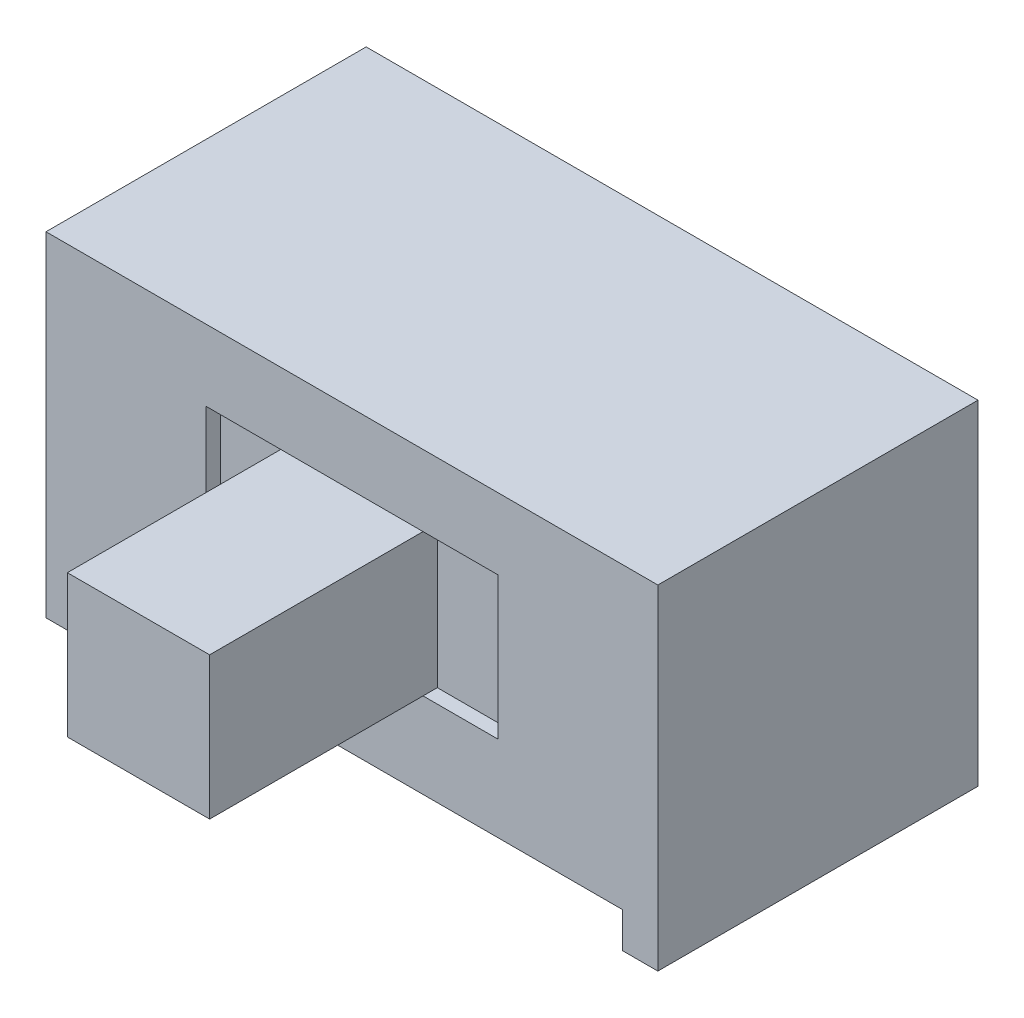
ISO-10303-21;
HEADER;
FILE_DESCRIPTION(('STEP AP214'),'2;1');
FILE_NAME('part.step','',(''),(''),'','','');
FILE_SCHEMA(('AUTOMOTIVE_DESIGN { 1 0 10303 214 1 1 1 1 }'));
ENDSEC;
DATA;
#1=APPLICATION_CONTEXT('core data for automotive mechanical design processes');
#2=APPLICATION_PROTOCOL_DEFINITION('international standard','automotive_design',2000,#1);
#3=PRODUCT_CONTEXT('',#1,'mechanical');
#4=PRODUCT('Part','Part','',(#3));
#5=PRODUCT_RELATED_PRODUCT_CATEGORY('part','',(#4));
#6=PRODUCT_DEFINITION_FORMATION('','',#4);
#7=PRODUCT_DEFINITION_CONTEXT('part definition',#1,'design');
#8=PRODUCT_DEFINITION('design','',#6,#7);
#9=PRODUCT_DEFINITION_SHAPE('','',#8);
#10=(LENGTH_UNIT() NAMED_UNIT(*) SI_UNIT(.MILLI.,.METRE.));
#11=(NAMED_UNIT(*) PLANE_ANGLE_UNIT() SI_UNIT($,.RADIAN.));
#12=(NAMED_UNIT(*) SI_UNIT($,.STERADIAN.) SOLID_ANGLE_UNIT());
#13=UNCERTAINTY_MEASURE_WITH_UNIT(LENGTH_MEASURE(1.E-05),#10,'distance_accuracy_value','');
#14=(GEOMETRIC_REPRESENTATION_CONTEXT(3) GLOBAL_UNCERTAINTY_ASSIGNED_CONTEXT((#13)) GLOBAL_UNIT_ASSIGNED_CONTEXT((#10,
#11,#12)) REPRESENTATION_CONTEXT('',''));
#15=CARTESIAN_POINT('',(0.,0.,0.));
#16=DIRECTION('',(0.,0.,1.));
#17=DIRECTION('',(1.,0.,0.));
#18=AXIS2_PLACEMENT_3D('',#15,#16,#17);
#19=CARTESIAN_POINT('',(2.25,3.7,-0.2));
#20=DIRECTION('',(0.,1.,0.));
#21=DIRECTION('',(-1.,0.,0.));
#22=AXIS2_PLACEMENT_3D('',#19,#20,#21);
#23=PLANE('',#22);
#24=DIRECTION('',(-1.,0.,0.));
#25=VECTOR('',#24,1.);
#26=CARTESIAN_POINT('',(2.25,3.7,-0.2));
#27=LINE('',#26,#25);
#28=CARTESIAN_POINT('',(3.3,3.7,-0.2));
#29=VERTEX_POINT('',#28);
#30=CARTESIAN_POINT('',(2.25,3.7,-0.2));
#31=VERTEX_POINT('',#30);
#32=EDGE_CURVE('E243',#29,#31,#27,.T.);
#33=ORIENTED_EDGE('',*,*,#32,.F.);
#34=DIRECTION('',(0.,0.,1.));
#35=VECTOR('',#34,1.);
#36=CARTESIAN_POINT('',(3.3,3.7,-3.02842712474619));
#37=LINE('',#36,#35);
#38=CARTESIAN_POINT('',(3.3,3.7,0.));
#39=VERTEX_POINT('',#38);
#40=EDGE_CURVE('E49',#29,#39,#37,.T.);
#41=ORIENTED_EDGE('',*,*,#40,.T.);
#42=DIRECTION('',(-1.,0.,0.));
#43=VECTOR('',#42,1.);
#44=CARTESIAN_POINT('',(2.25,3.7,0.));
#45=LINE('',#44,#43);
#46=CARTESIAN_POINT('',(2.25,3.7,0.));
#47=VERTEX_POINT('',#46);
#48=EDGE_CURVE('E255',#39,#47,#45,.T.);
#49=ORIENTED_EDGE('',*,*,#48,.T.);
#50=DIRECTION('',(0.,0.,1.));
#51=VECTOR('',#50,1.);
#52=CARTESIAN_POINT('',(2.25,3.7,-0.2));
#53=LINE('',#52,#51);
#54=EDGE_CURVE('E257',#31,#47,#53,.T.);
#55=ORIENTED_EDGE('',*,*,#54,.F.);
#56=EDGE_LOOP('',(#33,#41,#49,#55));
#57=FACE_BOUND('',#56,.T.);
#58=ADVANCED_FACE('F34',(#57),#23,.F.);
#59=CARTESIAN_POINT('',(2.25,1.7,-0.2));
#60=DIRECTION('',(0.,-1.,0.));
#61=DIRECTION('',(1.,0.,0.));
#62=AXIS2_PLACEMENT_3D('',#59,#60,#61);
#63=PLANE('',#62);
#64=DIRECTION('',(1.,0.,0.));
#65=VECTOR('',#64,1.);
#66=CARTESIAN_POINT('',(2.25,1.7,0.));
#67=LINE('',#66,#65);
#68=CARTESIAN_POINT('',(2.25,1.7,0.));
#69=VERTEX_POINT('',#68);
#70=CARTESIAN_POINT('',(3.3,1.7,0.));
#71=VERTEX_POINT('',#70);
#72=EDGE_CURVE('E249',#69,#71,#67,.T.);
#73=ORIENTED_EDGE('',*,*,#72,.T.);
#74=DIRECTION('',(0.,0.,1.));
#75=VECTOR('',#74,1.);
#76=CARTESIAN_POINT('',(3.3,1.7,-3.02842712474619));
#77=LINE('',#76,#75);
#78=CARTESIAN_POINT('',(3.3,1.7,-0.2));
#79=VERTEX_POINT('',#78);
#80=EDGE_CURVE('E169',#79,#71,#77,.T.);
#81=ORIENTED_EDGE('',*,*,#80,.F.);
#82=DIRECTION('',(1.,0.,0.));
#83=VECTOR('',#82,1.);
#84=CARTESIAN_POINT('',(2.25,1.7,-0.2));
#85=LINE('',#84,#83);
#86=CARTESIAN_POINT('',(2.25,1.7,-0.2));
#87=VERTEX_POINT('',#86);
#88=EDGE_CURVE('E237',#87,#79,#85,.T.);
#89=ORIENTED_EDGE('',*,*,#88,.F.);
#90=DIRECTION('',(0.,0.,1.));
#91=VECTOR('',#90,1.);
#92=CARTESIAN_POINT('',(2.25,1.7,-0.2));
#93=LINE('',#92,#91);
#94=EDGE_CURVE('E246',#87,#69,#93,.T.);
#95=ORIENTED_EDGE('',*,*,#94,.T.);
#96=EDGE_LOOP('',(#73,#81,#89,#95));
#97=FACE_BOUND('',#96,.T.);
#98=ADVANCED_FACE('F345',(#97),#63,.F.);
#99=CARTESIAN_POINT('',(0.,0.,-0.2));
#100=DIRECTION('',(0.,0.,1.));
#101=DIRECTION('',(1.,0.,0.));
#102=AXIS2_PLACEMENT_3D('',#99,#100,#101);
#103=PLANE('',#102);
#104=DIRECTION('',(0.,1.,0.));
#105=VECTOR('',#104,1.);
#106=CARTESIAN_POINT('',(3.3,3.7,-0.2));
#107=LINE('',#106,#105);
#108=EDGE_CURVE('E193',#79,#29,#107,.T.);
#109=ORIENTED_EDGE('',*,*,#108,.T.);
#110=ORIENTED_EDGE('',*,*,#32,.T.);
#111=DIRECTION('',(0.,-1.,0.));
#112=VECTOR('',#111,1.);
#113=CARTESIAN_POINT('',(2.25,3.7,-0.2));
#114=LINE('',#113,#112);
#115=EDGE_CURVE('E232',#31,#87,#114,.T.);
#116=ORIENTED_EDGE('',*,*,#115,.T.);
#117=ORIENTED_EDGE('',*,*,#88,.T.);
#118=EDGE_LOOP('',(#109,#110,#116,#117));
#119=FACE_BOUND('',#118,.T.);
#120=ADVANCED_FACE('F351',(#119),#103,.T.);
#121=CARTESIAN_POINT('',(0.,0.,0.));
#122=DIRECTION('',(0.,-1.,0.));
#123=DIRECTION('',(0.,0.,-1.));
#124=AXIS2_PLACEMENT_3D('',#121,#122,#123);
#125=PLANE('',#124);
#126=DIRECTION('',(0.,0.,1.));
#127=VECTOR('',#126,1.);
#128=CARTESIAN_POINT('',(0.5,0.,-4.501));
#129=LINE('',#128,#127);
#130=CARTESIAN_POINT('',(0.5,0.,-4.5));
#131=VERTEX_POINT('',#130);
#132=CARTESIAN_POINT('',(0.5,0.,0.));
#133=VERTEX_POINT('',#132);
#134=EDGE_CURVE('E221',#131,#133,#129,.T.);
#135=ORIENTED_EDGE('',*,*,#134,.T.);
#136=DIRECTION('',(1.,0.,0.));
#137=VECTOR('',#136,1.);
#138=CARTESIAN_POINT('',(0.,0.,0.));
#139=LINE('',#138,#137);
#140=CARTESIAN_POINT('',(0.,0.,0.));
#141=VERTEX_POINT('',#140);
#142=EDGE_CURVE('E282',#141,#133,#139,.T.);
#143=ORIENTED_EDGE('',*,*,#142,.F.);
#144=DIRECTION('',(0.,0.,1.));
#145=VECTOR('',#144,1.);
#146=CARTESIAN_POINT('',(0.,0.,0.));
#147=LINE('',#146,#145);
#148=CARTESIAN_POINT('',(0.,0.,-4.5));
#149=VERTEX_POINT('',#148);
#150=EDGE_CURVE('E260',#149,#141,#147,.T.);
#151=ORIENTED_EDGE('',*,*,#150,.F.);
#152=DIRECTION('',(-1.,0.,0.));
#153=VECTOR('',#152,1.);
#154=CARTESIAN_POINT('',(0.,0.,-4.5));
#155=LINE('',#154,#153);
#156=EDGE_CURVE('E287',#131,#149,#155,.T.);
#157=ORIENTED_EDGE('',*,*,#156,.F.);
#158=EDGE_LOOP('',(#135,#143,#151,#157));
#159=FACE_BOUND('',#158,.T.);
#160=ADVANCED_FACE('F323',(#159),#125,.T.);
#161=CARTESIAN_POINT('',(0.,4.7,0.));
#162=DIRECTION('',(1.,0.,0.));
#163=DIRECTION('',(0.,0.,-1.));
#164=AXIS2_PLACEMENT_3D('',#161,#162,#163);
#165=PLANE('',#164);
#166=ORIENTED_EDGE('',*,*,#150,.T.);
#167=DIRECTION('',(0.,-1.,0.));
#168=VECTOR('',#167,1.);
#169=CARTESIAN_POINT('',(0.,4.7,0.));
#170=LINE('',#169,#168);
#171=CARTESIAN_POINT('',(0.,4.7,0.));
#172=VERTEX_POINT('',#171);
#173=EDGE_CURVE('E11',#172,#141,#170,.T.);
#174=ORIENTED_EDGE('',*,*,#173,.F.);
#175=DIRECTION('',(0.,0.,1.));
#176=VECTOR('',#175,1.);
#177=CARTESIAN_POINT('',(0.,4.7,0.));
#178=LINE('',#177,#176);
#179=CARTESIAN_POINT('',(0.,4.7,-4.5));
#180=VERTEX_POINT('',#179);
#181=EDGE_CURVE('E268',#180,#172,#178,.T.);
#182=ORIENTED_EDGE('',*,*,#181,.F.);
#183=DIRECTION('',(0.,-1.,0.));
#184=VECTOR('',#183,1.);
#185=CARTESIAN_POINT('',(0.,4.7,-4.5));
#186=LINE('',#185,#184);
#187=EDGE_CURVE('E278',#180,#149,#186,.T.);
#188=ORIENTED_EDGE('',*,*,#187,.T.);
#189=EDGE_LOOP('',(#166,#174,#182,#188));
#190=FACE_BOUND('',#189,.T.);
#191=ADVANCED_FACE('F36',(#190),#165,.F.);
#192=CARTESIAN_POINT('',(0.,4.7,0.));
#193=DIRECTION('',(0.,0.,-1.));
#194=DIRECTION('',(-1.,0.,0.));
#195=AXIS2_PLACEMENT_3D('',#192,#193,#194);
#196=PLANE('',#195);
#197=ORIENTED_EDGE('',*,*,#72,.F.);
#198=DIRECTION('',(0.,-1.,0.));
#199=VECTOR('',#198,1.);
#200=CARTESIAN_POINT('',(2.25,3.7,0.));
#201=LINE('',#200,#199);
#202=EDGE_CURVE('E231',#47,#69,#201,.T.);
#203=ORIENTED_EDGE('',*,*,#202,.F.);
#204=ORIENTED_EDGE('',*,*,#48,.F.);
#205=DIRECTION('',(1.,0.,0.));
#206=VECTOR('',#205,1.);
#207=CARTESIAN_POINT('',(0.,3.7,0.));
#208=LINE('',#207,#206);
#209=CARTESIAN_POINT('',(5.3,3.7,0.));
#210=VERTEX_POINT('',#209);
#211=EDGE_CURVE('E56',#39,#210,#208,.T.);
#212=ORIENTED_EDGE('',*,*,#211,.T.);
#213=CARTESIAN_POINT('',(6.35,3.7,0.));
#214=VERTEX_POINT('',#213);
#215=EDGE_CURVE('E236',#214,#210,#45,.T.);
#216=ORIENTED_EDGE('',*,*,#215,.F.);
#217=DIRECTION('',(0.,1.,0.));
#218=VECTOR('',#217,1.);
#219=CARTESIAN_POINT('',(6.35,3.7,0.));
#220=LINE('',#219,#218);
#221=CARTESIAN_POINT('',(6.35,1.7,0.));
#222=VERTEX_POINT('',#221);
#223=EDGE_CURVE('E252',#222,#214,#220,.T.);
#224=ORIENTED_EDGE('',*,*,#223,.F.);
#225=CARTESIAN_POINT('',(5.3,1.7,0.));
#226=VERTEX_POINT('',#225);
#227=EDGE_CURVE('E248',#226,#222,#67,.T.);
#228=ORIENTED_EDGE('',*,*,#227,.F.);
#229=DIRECTION('',(-1.,0.,0.));
#230=VECTOR('',#229,1.);
#231=CARTESIAN_POINT('',(0.,1.7,0.));
#232=LINE('',#231,#230);
#233=EDGE_CURVE('E195',#226,#71,#232,.T.);
#234=ORIENTED_EDGE('',*,*,#233,.T.);
#235=EDGE_LOOP('',(#197,#203,#204,#212,#216,#224,#228,#234));
#236=FACE_BOUND('',#235,.T.);
#237=ORIENTED_EDGE('',*,*,#142,.T.);
#238=DIRECTION('',(0.,-1.,0.));
#239=VECTOR('',#238,1.);
#240=CARTESIAN_POINT('',(0.5,0.,0.));
#241=LINE('',#240,#239);
#242=CARTESIAN_POINT('',(0.5,0.5,0.));
#243=VERTEX_POINT('',#242);
#244=EDGE_CURVE('E218',#243,#133,#241,.T.);
#245=ORIENTED_EDGE('',*,*,#244,.F.);
#246=DIRECTION('',(-1.,0.,0.));
#247=VECTOR('',#246,1.);
#248=CARTESIAN_POINT('',(0.5,0.5,0.));
#249=LINE('',#248,#247);
#250=CARTESIAN_POINT('',(8.1,0.5,0.));
#251=VERTEX_POINT('',#250);
#252=EDGE_CURVE('E215',#251,#243,#249,.T.);
#253=ORIENTED_EDGE('',*,*,#252,.F.);
#254=DIRECTION('',(0.,1.,0.));
#255=VECTOR('',#254,1.);
#256=CARTESIAN_POINT('',(8.1,0.5,0.));
#257=LINE('',#256,#255);
#258=CARTESIAN_POINT('',(8.1,0.,0.));
#259=VERTEX_POINT('',#258);
#260=EDGE_CURVE('E212',#259,#251,#257,.T.);
#261=ORIENTED_EDGE('',*,*,#260,.F.);
#262=CARTESIAN_POINT('',(8.6,0.,0.));
#263=VERTEX_POINT('',#262);
#264=EDGE_CURVE('E281',#259,#263,#139,.T.);
#265=ORIENTED_EDGE('',*,*,#264,.T.);
#266=DIRECTION('',(0.,-1.,0.));
#267=VECTOR('',#266,1.);
#268=CARTESIAN_POINT('',(8.6,4.7,0.));
#269=LINE('',#268,#267);
#270=CARTESIAN_POINT('',(8.6,4.7,0.));
#271=VERTEX_POINT('',#270);
#272=EDGE_CURVE('E42',#271,#263,#269,.T.);
#273=ORIENTED_EDGE('',*,*,#272,.F.);
#274=DIRECTION('',(1.,0.,0.));
#275=VECTOR('',#274,1.);
#276=CARTESIAN_POINT('',(0.,4.7,0.));
#277=LINE('',#276,#275);
#278=EDGE_CURVE('E271',#172,#271,#277,.T.);
#279=ORIENTED_EDGE('',*,*,#278,.F.);
#280=ORIENTED_EDGE('',*,*,#173,.T.);
#281=EDGE_LOOP('',(#237,#245,#253,#261,#265,#273,#279,#280));
#282=FACE_BOUND('',#281,.T.);
#283=ADVANCED_FACE('F317',(#236,#282),#196,.F.);
#284=CARTESIAN_POINT('',(8.6,4.7,0.));
#285=DIRECTION('',(-1.,0.,0.));
#286=DIRECTION('',(0.,0.,1.));
#287=AXIS2_PLACEMENT_3D('',#284,#285,#286);
#288=PLANE('',#287);
#289=DIRECTION('',(0.,0.,-1.));
#290=VECTOR('',#289,1.);
#291=CARTESIAN_POINT('',(8.6,0.,0.));
#292=LINE('',#291,#290);
#293=CARTESIAN_POINT('',(8.6,0.,-4.5));
#294=VERTEX_POINT('',#293);
#295=EDGE_CURVE('E285',#263,#294,#292,.T.);
#296=ORIENTED_EDGE('',*,*,#295,.T.);
#297=DIRECTION('',(0.,-1.,0.));
#298=VECTOR('',#297,1.);
#299=CARTESIAN_POINT('',(8.6,4.7,-4.5));
#300=LINE('',#299,#298);
#301=CARTESIAN_POINT('',(8.6,4.7,-4.5));
#302=VERTEX_POINT('',#301);
#303=EDGE_CURVE('E292',#302,#294,#300,.T.);
#304=ORIENTED_EDGE('',*,*,#303,.F.);
#305=DIRECTION('',(0.,0.,-1.));
#306=VECTOR('',#305,1.);
#307=CARTESIAN_POINT('',(8.6,4.7,0.));
#308=LINE('',#307,#306);
#309=EDGE_CURVE('E274',#271,#302,#308,.T.);
#310=ORIENTED_EDGE('',*,*,#309,.F.);
#311=ORIENTED_EDGE('',*,*,#272,.T.);
#312=EDGE_LOOP('',(#296,#304,#310,#311));
#313=FACE_BOUND('',#312,.T.);
#314=ADVANCED_FACE('F299',(#313),#288,.F.);
#315=CARTESIAN_POINT('',(0.,4.7,-4.5));
#316=DIRECTION('',(0.,0.,1.));
#317=DIRECTION('',(1.,0.,0.));
#318=AXIS2_PLACEMENT_3D('',#315,#316,#317);
#319=PLANE('',#318);
#320=DIRECTION('',(1.,0.,0.));
#321=VECTOR('',#320,1.);
#322=CARTESIAN_POINT('',(0.5,0.5,-4.5));
#323=LINE('',#322,#321);
#324=CARTESIAN_POINT('',(0.5,0.5,-4.5));
#325=VERTEX_POINT('',#324);
#326=CARTESIAN_POINT('',(8.1,0.5,-4.5));
#327=VERTEX_POINT('',#326);
#328=EDGE_CURVE('E206',#325,#327,#323,.T.);
#329=ORIENTED_EDGE('',*,*,#328,.F.);
#330=DIRECTION('',(0.,1.,0.));
#331=VECTOR('',#330,1.);
#332=CARTESIAN_POINT('',(0.5,0.,-4.5));
#333=LINE('',#332,#331);
#334=EDGE_CURVE('E209',#131,#325,#333,.T.);
#335=ORIENTED_EDGE('',*,*,#334,.F.);
#336=ORIENTED_EDGE('',*,*,#156,.T.);
#337=ORIENTED_EDGE('',*,*,#187,.F.);
#338=DIRECTION('',(-1.,0.,0.));
#339=VECTOR('',#338,1.);
#340=CARTESIAN_POINT('',(0.,4.7,-4.5));
#341=LINE('',#340,#339);
#342=EDGE_CURVE('E276',#302,#180,#341,.T.);
#343=ORIENTED_EDGE('',*,*,#342,.F.);
#344=ORIENTED_EDGE('',*,*,#303,.T.);
#345=CARTESIAN_POINT('',(8.1,0.,-4.5));
#346=VERTEX_POINT('',#345);
#347=EDGE_CURVE('E272',#294,#346,#155,.T.);
#348=ORIENTED_EDGE('',*,*,#347,.T.);
#349=DIRECTION('',(0.,-1.,0.));
#350=VECTOR('',#349,1.);
#351=CARTESIAN_POINT('',(8.1,0.5,-4.5));
#352=LINE('',#351,#350);
#353=EDGE_CURVE('E224',#327,#346,#352,.T.);
#354=ORIENTED_EDGE('',*,*,#353,.F.);
#355=EDGE_LOOP('',(#329,#335,#336,#337,#343,#344,#348,#354));
#356=FACE_BOUND('',#355,.T.);
#357=ADVANCED_FACE('F310',(#356),#319,.F.);
#358=CARTESIAN_POINT('',(0.,4.7,0.));
#359=DIRECTION('',(0.,-1.,0.));
#360=DIRECTION('',(0.,0.,-1.));
#361=AXIS2_PLACEMENT_3D('',#358,#359,#360);
#362=PLANE('',#361);
#363=ORIENTED_EDGE('',*,*,#181,.T.);
#364=ORIENTED_EDGE('',*,*,#278,.T.);
#365=ORIENTED_EDGE('',*,*,#309,.T.);
#366=ORIENTED_EDGE('',*,*,#342,.T.);
#367=EDGE_LOOP('',(#363,#364,#365,#366));
#368=FACE_BOUND('',#367,.T.);
#369=ADVANCED_FACE('F315',(#368),#362,.F.);
#370=DIRECTION('',(0.,0.,1.));
#371=VECTOR('',#370,1.);
#372=CARTESIAN_POINT('',(8.1,0.,-4.501));
#373=LINE('',#372,#371);
#374=EDGE_CURVE('E220',#346,#259,#373,.T.);
#375=ORIENTED_EDGE('',*,*,#374,.F.);
#376=ORIENTED_EDGE('',*,*,#347,.F.);
#377=ORIENTED_EDGE('',*,*,#295,.F.);
#378=ORIENTED_EDGE('',*,*,#264,.F.);
#379=EDGE_LOOP('',(#375,#376,#377,#378));
#380=FACE_BOUND('',#379,.T.);
#381=ADVANCED_FACE('F306',(#380),#125,.T.);
#382=CARTESIAN_POINT('',(2.25,3.7,-0.2));
#383=DIRECTION('',(-1.,0.,0.));
#384=DIRECTION('',(0.,-1.,0.));
#385=AXIS2_PLACEMENT_3D('',#382,#383,#384);
#386=PLANE('',#385);
#387=ORIENTED_EDGE('',*,*,#202,.T.);
#388=ORIENTED_EDGE('',*,*,#94,.F.);
#389=ORIENTED_EDGE('',*,*,#115,.F.);
#390=ORIENTED_EDGE('',*,*,#54,.T.);
#391=EDGE_LOOP('',(#387,#388,#389,#390));
#392=FACE_BOUND('',#391,.T.);
#393=ADVANCED_FACE('F358',(#392),#386,.F.);
#394=ORIENTED_EDGE('',*,*,#215,.T.);
#395=DIRECTION('',(0.,0.,1.));
#396=VECTOR('',#395,1.);
#397=CARTESIAN_POINT('',(5.3,3.7,-3.02842712474619));
#398=LINE('',#397,#396);
#399=CARTESIAN_POINT('',(5.3,3.7,-0.2));
#400=VERTEX_POINT('',#399);
#401=EDGE_CURVE('E198',#400,#210,#398,.T.);
#402=ORIENTED_EDGE('',*,*,#401,.F.);
#403=CARTESIAN_POINT('',(6.35,3.7,-0.2));
#404=VERTEX_POINT('',#403);
#405=EDGE_CURVE('E244',#404,#400,#27,.T.);
#406=ORIENTED_EDGE('',*,*,#405,.F.);
#407=DIRECTION('',(0.,0.,1.));
#408=VECTOR('',#407,1.);
#409=CARTESIAN_POINT('',(6.35,3.7,-0.2));
#410=LINE('',#409,#408);
#411=EDGE_CURVE('E261',#404,#214,#410,.T.);
#412=ORIENTED_EDGE('',*,*,#411,.T.);
#413=EDGE_LOOP('',(#394,#402,#406,#412));
#414=FACE_BOUND('',#413,.T.);
#415=ADVANCED_FACE('F347',(#414),#23,.F.);
#416=CARTESIAN_POINT('',(6.35,3.7,-0.2));
#417=DIRECTION('',(1.,0.,0.));
#418=DIRECTION('',(0.,0.,-1.));
#419=AXIS2_PLACEMENT_3D('',#416,#417,#418);
#420=PLANE('',#419);
#421=ORIENTED_EDGE('',*,*,#223,.T.);
#422=ORIENTED_EDGE('',*,*,#411,.F.);
#423=DIRECTION('',(0.,1.,0.));
#424=VECTOR('',#423,1.);
#425=CARTESIAN_POINT('',(6.35,3.7,-0.2));
#426=LINE('',#425,#424);
#427=CARTESIAN_POINT('',(6.35,1.7,-0.2));
#428=VERTEX_POINT('',#427);
#429=EDGE_CURVE('E240',#428,#404,#426,.T.);
#430=ORIENTED_EDGE('',*,*,#429,.F.);
#431=DIRECTION('',(0.,0.,1.));
#432=VECTOR('',#431,1.);
#433=CARTESIAN_POINT('',(6.35,1.7,-0.2));
#434=LINE('',#433,#432);
#435=EDGE_CURVE('E263',#428,#222,#434,.T.);
#436=ORIENTED_EDGE('',*,*,#435,.T.);
#437=EDGE_LOOP('',(#421,#422,#430,#436));
#438=FACE_BOUND('',#437,.T.);
#439=ADVANCED_FACE('F357',(#438),#420,.F.);
#440=CARTESIAN_POINT('',(5.3,1.7,-0.2));
#441=VERTEX_POINT('',#440);
#442=EDGE_CURVE('E235',#441,#428,#85,.T.);
#443=ORIENTED_EDGE('',*,*,#442,.F.);
#444=DIRECTION('',(0.,0.,1.));
#445=VECTOR('',#444,1.);
#446=CARTESIAN_POINT('',(5.3,1.7,-3.02842712474619));
#447=LINE('',#446,#445);
#448=EDGE_CURVE('E202',#441,#226,#447,.T.);
#449=ORIENTED_EDGE('',*,*,#448,.T.);
#450=ORIENTED_EDGE('',*,*,#227,.T.);
#451=ORIENTED_EDGE('',*,*,#435,.F.);
#452=EDGE_LOOP('',(#443,#449,#450,#451));
#453=FACE_BOUND('',#452,.T.);
#454=ADVANCED_FACE('F354',(#453),#63,.F.);
#455=DIRECTION('',(0.,-1.,0.));
#456=VECTOR('',#455,1.);
#457=CARTESIAN_POINT('',(5.3,3.7,-0.2));
#458=LINE('',#457,#456);
#459=EDGE_CURVE('E191',#400,#441,#458,.T.);
#460=ORIENTED_EDGE('',*,*,#459,.T.);
#461=ORIENTED_EDGE('',*,*,#442,.T.);
#462=ORIENTED_EDGE('',*,*,#429,.T.);
#463=ORIENTED_EDGE('',*,*,#405,.T.);
#464=EDGE_LOOP('',(#460,#461,#462,#463));
#465=FACE_BOUND('',#464,.T.);
#466=ADVANCED_FACE('F377',(#465),#103,.T.);
#467=CARTESIAN_POINT('',(0.5,0.,-4.501));
#468=DIRECTION('',(-1.,0.,0.));
#469=DIRECTION('',(0.,0.,1.));
#470=AXIS2_PLACEMENT_3D('',#467,#468,#469);
#471=PLANE('',#470);
#472=ORIENTED_EDGE('',*,*,#334,.T.);
#473=DIRECTION('',(0.,0.,1.));
#474=VECTOR('',#473,1.);
#475=CARTESIAN_POINT('',(0.5,0.5,-4.501));
#476=LINE('',#475,#474);
#477=EDGE_CURVE('E225',#325,#243,#476,.T.);
#478=ORIENTED_EDGE('',*,*,#477,.T.);
#479=ORIENTED_EDGE('',*,*,#244,.T.);
#480=ORIENTED_EDGE('',*,*,#134,.F.);
#481=EDGE_LOOP('',(#472,#478,#479,#480));
#482=FACE_BOUND('',#481,.T.);
#483=ADVANCED_FACE('F326',(#482),#471,.F.);
#484=CARTESIAN_POINT('',(0.5,0.5,-4.501));
#485=DIRECTION('',(0.,1.,0.));
#486=DIRECTION('',(0.,0.,1.));
#487=AXIS2_PLACEMENT_3D('',#484,#485,#486);
#488=PLANE('',#487);
#489=ORIENTED_EDGE('',*,*,#328,.T.);
#490=DIRECTION('',(0.,0.,1.));
#491=VECTOR('',#490,1.);
#492=CARTESIAN_POINT('',(8.1,0.5,-4.501));
#493=LINE('',#492,#491);
#494=EDGE_CURVE('E227',#327,#251,#493,.T.);
#495=ORIENTED_EDGE('',*,*,#494,.T.);
#496=ORIENTED_EDGE('',*,*,#252,.T.);
#497=ORIENTED_EDGE('',*,*,#477,.F.);
#498=EDGE_LOOP('',(#489,#495,#496,#497));
#499=FACE_BOUND('',#498,.T.);
#500=ADVANCED_FACE('F328',(#499),#488,.F.);
#501=CARTESIAN_POINT('',(8.1,0.5,-4.501));
#502=DIRECTION('',(1.,0.,0.));
#503=DIRECTION('',(0.,0.,-1.));
#504=AXIS2_PLACEMENT_3D('',#501,#502,#503);
#505=PLANE('',#504);
#506=ORIENTED_EDGE('',*,*,#353,.T.);
#507=ORIENTED_EDGE('',*,*,#374,.T.);
#508=ORIENTED_EDGE('',*,*,#260,.T.);
#509=ORIENTED_EDGE('',*,*,#494,.F.);
#510=EDGE_LOOP('',(#506,#507,#508,#509));
#511=FACE_BOUND('',#510,.T.);
#512=ADVANCED_FACE('F332',(#511),#505,.F.);
#513=CARTESIAN_POINT('',(3.3,3.7,-3.02842712474619));
#514=DIRECTION('',(0.,1.,0.));
#515=DIRECTION('',(-1.,0.,0.));
#516=AXIS2_PLACEMENT_3D('',#513,#514,#515);
#517=PLANE('',#516);
#518=ORIENTED_EDGE('',*,*,#211,.F.);
#519=CARTESIAN_POINT('',(3.3,3.7,3.));
#520=VERTEX_POINT('',#519);
#521=EDGE_CURVE('E197',#39,#520,#37,.T.);
#522=ORIENTED_EDGE('',*,*,#521,.T.);
#523=DIRECTION('',(-1.,0.,0.));
#524=VECTOR('',#523,1.);
#525=CARTESIAN_POINT('',(3.3,3.7,3.));
#526=LINE('',#525,#524);
#527=CARTESIAN_POINT('',(5.3,3.7,3.));
#528=VERTEX_POINT('',#527);
#529=EDGE_CURVE('E172',#528,#520,#526,.T.);
#530=ORIENTED_EDGE('',*,*,#529,.F.);
#531=EDGE_CURVE('E201',#210,#528,#398,.T.);
#532=ORIENTED_EDGE('',*,*,#531,.F.);
#533=EDGE_LOOP('',(#518,#522,#530,#532));
#534=FACE_BOUND('',#533,.T.);
#535=ADVANCED_FACE('F334',(#534),#517,.T.);
#536=CARTESIAN_POINT('',(3.3,1.7,-3.02842712474619));
#537=DIRECTION('',(0.,-1.,0.));
#538=DIRECTION('',(1.,0.,0.));
#539=AXIS2_PLACEMENT_3D('',#536,#537,#538);
#540=PLANE('',#539);
#541=ORIENTED_EDGE('',*,*,#233,.F.);
#542=CARTESIAN_POINT('',(5.3,1.7,3.));
#543=VERTEX_POINT('',#542);
#544=EDGE_CURVE('E178',#226,#543,#447,.T.);
#545=ORIENTED_EDGE('',*,*,#544,.T.);
#546=DIRECTION('',(1.,0.,0.));
#547=VECTOR('',#546,1.);
#548=CARTESIAN_POINT('',(3.3,1.7,3.));
#549=LINE('',#548,#547);
#550=CARTESIAN_POINT('',(3.3,1.7,3.));
#551=VERTEX_POINT('',#550);
#552=EDGE_CURVE('E175',#551,#543,#549,.T.);
#553=ORIENTED_EDGE('',*,*,#552,.F.);
#554=EDGE_CURVE('E162',#71,#551,#77,.T.);
#555=ORIENTED_EDGE('',*,*,#554,.F.);
#556=EDGE_LOOP('',(#541,#545,#553,#555));
#557=FACE_BOUND('',#556,.T.);
#558=ADVANCED_FACE('F176',(#557),#540,.T.);
#559=CARTESIAN_POINT('',(3.3,3.7,-3.02842712474619));
#560=DIRECTION('',(-1.,0.,0.));
#561=DIRECTION('',(0.,-1.,0.));
#562=AXIS2_PLACEMENT_3D('',#559,#560,#561);
#563=PLANE('',#562);
#564=ORIENTED_EDGE('',*,*,#108,.F.);
#565=ORIENTED_EDGE('',*,*,#80,.T.);
#566=ORIENTED_EDGE('',*,*,#554,.T.);
#567=DIRECTION('',(0.,-1.,0.));
#568=VECTOR('',#567,1.);
#569=CARTESIAN_POINT('',(3.3,3.7,3.));
#570=LINE('',#569,#568);
#571=EDGE_CURVE('E168',#520,#551,#570,.T.);
#572=ORIENTED_EDGE('',*,*,#571,.F.);
#573=ORIENTED_EDGE('',*,*,#521,.F.);
#574=ORIENTED_EDGE('',*,*,#40,.F.);
#575=EDGE_LOOP('',(#564,#565,#566,#572,#573,#574));
#576=FACE_BOUND('',#575,.T.);
#577=ADVANCED_FACE('F165',(#576),#563,.T.);
#578=CARTESIAN_POINT('',(5.3,3.7,-3.02842712474619));
#579=DIRECTION('',(1.,0.,0.));
#580=DIRECTION('',(0.,0.,-1.));
#581=AXIS2_PLACEMENT_3D('',#578,#579,#580);
#582=PLANE('',#581);
#583=ORIENTED_EDGE('',*,*,#459,.F.);
#584=ORIENTED_EDGE('',*,*,#401,.T.);
#585=ORIENTED_EDGE('',*,*,#531,.T.);
#586=DIRECTION('',(0.,1.,0.));
#587=VECTOR('',#586,1.);
#588=CARTESIAN_POINT('',(5.3,3.7,3.));
#589=LINE('',#588,#587);
#590=EDGE_CURVE('E182',#543,#528,#589,.T.);
#591=ORIENTED_EDGE('',*,*,#590,.F.);
#592=ORIENTED_EDGE('',*,*,#544,.F.);
#593=ORIENTED_EDGE('',*,*,#448,.F.);
#594=EDGE_LOOP('',(#583,#584,#585,#591,#592,#593));
#595=FACE_BOUND('',#594,.T.);
#596=ADVANCED_FACE('F373',(#595),#582,.T.);
#597=CARTESIAN_POINT('',(0.,0.,3.));
#598=DIRECTION('',(0.,0.,1.));
#599=DIRECTION('',(1.,0.,0.));
#600=AXIS2_PLACEMENT_3D('',#597,#598,#599);
#601=PLANE('',#600);
#602=ORIENTED_EDGE('',*,*,#571,.T.);
#603=ORIENTED_EDGE('',*,*,#552,.T.);
#604=ORIENTED_EDGE('',*,*,#590,.T.);
#605=ORIENTED_EDGE('',*,*,#529,.T.);
#606=EDGE_LOOP('',(#602,#603,#604,#605));
#607=FACE_BOUND('',#606,.T.);
#608=ADVANCED_FACE('F185',(#607),#601,.T.);
#609=CLOSED_SHELL('',(#58,#98,#120,#160,#191,#283,#314,#357,#369,#381,#393,#415,#439,#454,#466,
#483,#500,#512,#535,#558,#577,#596,#608));
#610=MANIFOLD_SOLID_BREP('B2',#609);
#611=ADVANCED_BREP_SHAPE_REPRESENTATION('',(#18,#610),#14);
#612=SHAPE_DEFINITION_REPRESENTATION(#9,#611);
ENDSEC;
END-ISO-10303-21;
